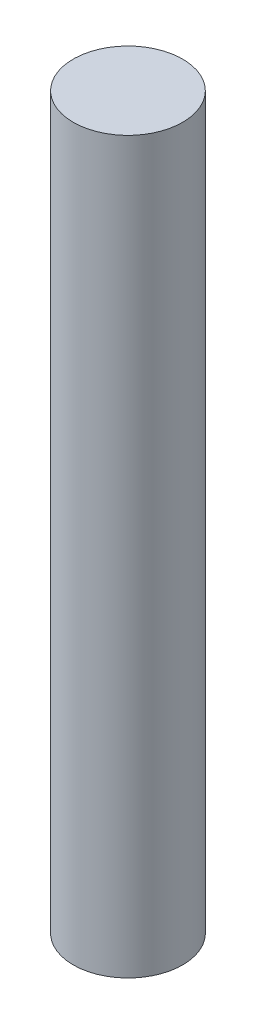
ISO-10303-21;
HEADER;
FILE_DESCRIPTION(('STEP AP214'),'2;1');
FILE_NAME('part.step','',(''),(''),'','','');
FILE_SCHEMA(('AUTOMOTIVE_DESIGN { 1 0 10303 214 1 1 1 1 }'));
ENDSEC;
DATA;
#1=APPLICATION_CONTEXT('core data for automotive mechanical design processes');
#2=APPLICATION_PROTOCOL_DEFINITION('international standard','automotive_design',2000,#1);
#3=PRODUCT_CONTEXT('',#1,'mechanical');
#4=PRODUCT('Part','Part','',(#3));
#5=PRODUCT_RELATED_PRODUCT_CATEGORY('part','',(#4));
#6=PRODUCT_DEFINITION_FORMATION('','',#4);
#7=PRODUCT_DEFINITION_CONTEXT('part definition',#1,'design');
#8=PRODUCT_DEFINITION('design','',#6,#7);
#9=PRODUCT_DEFINITION_SHAPE('','',#8);
#10=(LENGTH_UNIT() NAMED_UNIT(*) SI_UNIT(.MILLI.,.METRE.));
#11=(NAMED_UNIT(*) PLANE_ANGLE_UNIT() SI_UNIT($,.RADIAN.));
#12=(NAMED_UNIT(*) SI_UNIT($,.STERADIAN.) SOLID_ANGLE_UNIT());
#13=UNCERTAINTY_MEASURE_WITH_UNIT(LENGTH_MEASURE(1.E-05),#10,'distance_accuracy_value','');
#14=(GEOMETRIC_REPRESENTATION_CONTEXT(3) GLOBAL_UNCERTAINTY_ASSIGNED_CONTEXT((#13)) GLOBAL_UNIT_ASSIGNED_CONTEXT((#10,
#11,#12)) REPRESENTATION_CONTEXT('',''));
#15=CARTESIAN_POINT('',(0.,0.,0.));
#16=DIRECTION('',(0.,0.,1.));
#17=DIRECTION('',(1.,0.,0.));
#18=AXIS2_PLACEMENT_3D('',#15,#16,#17);
#19=CARTESIAN_POINT('',(0.,20.,0.));
#20=DIRECTION('',(0.,-1.,0.));
#21=DIRECTION('',(0.,0.,-1.));
#22=AXIS2_PLACEMENT_3D('',#19,#20,#21);
#23=CYLINDRICAL_SURFACE('',#22,1.5);
#24=CARTESIAN_POINT('',(0.,20.,0.));
#25=DIRECTION('',(0.,1.,0.));
#26=DIRECTION('',(0.,0.,1.));
#27=AXIS2_PLACEMENT_3D('',#24,#25,#26);
#28=CIRCLE('',#27,1.5);
#29=CARTESIAN_POINT('',(0.,20.,1.5));
#30=VERTEX_POINT('',#29);
#31=EDGE_CURVE('E10',#30,#30,#28,.T.);
#32=ORIENTED_EDGE('',*,*,#31,.F.);
#33=EDGE_LOOP('',(#32));
#34=FACE_BOUND('',#33,.T.);
#35=CARTESIAN_POINT('',(0.,0.,0.));
#36=DIRECTION('',(0.,1.,0.));
#37=DIRECTION('',(0.,0.,1.));
#38=AXIS2_PLACEMENT_3D('',#35,#36,#37);
#39=CIRCLE('',#38,1.5);
#40=CARTESIAN_POINT('',(0.,0.,1.5));
#41=VERTEX_POINT('',#40);
#42=EDGE_CURVE('E34',#41,#41,#39,.T.);
#43=ORIENTED_EDGE('',*,*,#42,.T.);
#44=EDGE_LOOP('',(#43));
#45=FACE_BOUND('',#44,.T.);
#46=ADVANCED_FACE('F31',(#34,#45),#23,.T.);
#47=CARTESIAN_POINT('',(0.,20.,0.));
#48=DIRECTION('',(0.,1.,0.));
#49=DIRECTION('',(0.,0.,1.));
#50=AXIS2_PLACEMENT_3D('',#47,#48,#49);
#51=PLANE('',#50);
#52=ORIENTED_EDGE('',*,*,#31,.T.);
#53=EDGE_LOOP('',(#52));
#54=FACE_BOUND('',#53,.T.);
#55=ADVANCED_FACE('F46',(#54),#51,.T.);
#56=CARTESIAN_POINT('',(0.,0.,0.));
#57=DIRECTION('',(0.,1.,0.));
#58=DIRECTION('',(0.,0.,1.));
#59=AXIS2_PLACEMENT_3D('',#56,#57,#58);
#60=PLANE('',#59);
#61=ORIENTED_EDGE('',*,*,#42,.F.);
#62=EDGE_LOOP('',(#61));
#63=FACE_BOUND('',#62,.T.);
#64=ADVANCED_FACE('F44',(#63),#60,.F.);
#65=CLOSED_SHELL('',(#46,#55,#64));
#66=MANIFOLD_SOLID_BREP('B2',#65);
#67=ADVANCED_BREP_SHAPE_REPRESENTATION('',(#18,#66),#14);
#68=SHAPE_DEFINITION_REPRESENTATION(#9,#67);
ENDSEC;
END-ISO-10303-21;
